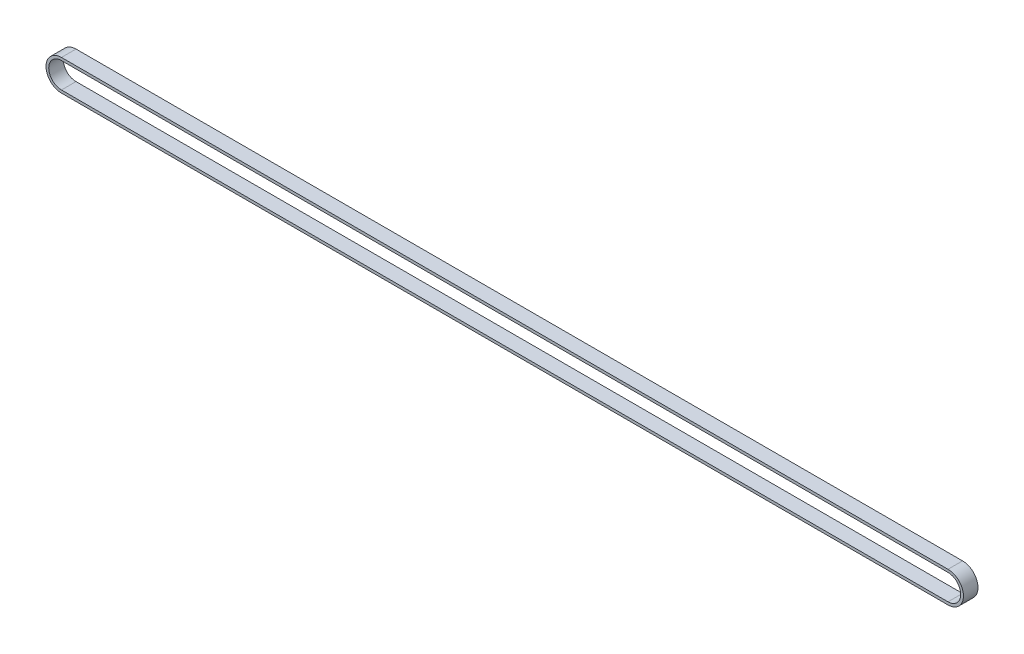
ISO-10303-21;
HEADER;
FILE_DESCRIPTION(('STEP AP214'),'2;1');
FILE_NAME('part.step','',(''),(''),'','','');
FILE_SCHEMA(('AUTOMOTIVE_DESIGN { 1 0 10303 214 1 1 1 1 }'));
ENDSEC;
DATA;
#1=APPLICATION_CONTEXT('core data for automotive mechanical design processes');
#2=APPLICATION_PROTOCOL_DEFINITION('international standard','automotive_design',2000,#1);
#3=PRODUCT_CONTEXT('',#1,'mechanical');
#4=PRODUCT('Part','Part','',(#3));
#5=PRODUCT_RELATED_PRODUCT_CATEGORY('part','',(#4));
#6=PRODUCT_DEFINITION_FORMATION('','',#4);
#7=PRODUCT_DEFINITION_CONTEXT('part definition',#1,'design');
#8=PRODUCT_DEFINITION('design','',#6,#7);
#9=PRODUCT_DEFINITION_SHAPE('','',#8);
#10=(LENGTH_UNIT() NAMED_UNIT(*) SI_UNIT(.MILLI.,.METRE.));
#11=(NAMED_UNIT(*) PLANE_ANGLE_UNIT() SI_UNIT($,.RADIAN.));
#12=(NAMED_UNIT(*) SI_UNIT($,.STERADIAN.) SOLID_ANGLE_UNIT());
#13=UNCERTAINTY_MEASURE_WITH_UNIT(LENGTH_MEASURE(1.E-05),#10,'distance_accuracy_value','');
#14=(GEOMETRIC_REPRESENTATION_CONTEXT(3) GLOBAL_UNCERTAINTY_ASSIGNED_CONTEXT((#13)) GLOBAL_UNIT_ASSIGNED_CONTEXT((#10,
#11,#12)) REPRESENTATION_CONTEXT('',''));
#15=CARTESIAN_POINT('',(0.,0.,0.));
#16=DIRECTION('',(0.,0.,1.));
#17=DIRECTION('',(1.,0.,0.));
#18=AXIS2_PLACEMENT_3D('',#15,#16,#17);
#19=CARTESIAN_POINT('',(0.,0.,6.4));
#20=DIRECTION('',(0.,0.,1.));
#21=DIRECTION('',(1.,0.,0.));
#22=AXIS2_PLACEMENT_3D('',#19,#20,#21);
#23=PLANE('',#22);
#24=CARTESIAN_POINT('',(0.,0.,6.4));
#25=DIRECTION('',(0.,0.,1.));
#26=DIRECTION('',(1.,0.,0.));
#27=AXIS2_PLACEMENT_3D('',#24,#25,#26);
#28=CIRCLE('',#27,6.80000000000008);
#29=CARTESIAN_POINT('',(0.,-6.80000000000008,6.4));
#30=VERTEX_POINT('',#29);
#31=CARTESIAN_POINT('',(0.,6.80000000000008,6.4));
#32=VERTEX_POINT('',#31);
#33=EDGE_CURVE('E134',#30,#32,#28,.T.);
#34=ORIENTED_EDGE('',*,*,#33,.T.);
#35=DIRECTION('',(-1.,0.,0.));
#36=VECTOR('',#35,1.);
#37=CARTESIAN_POINT('',(0.,6.80000000000008,6.4));
#38=LINE('',#37,#36);
#39=CARTESIAN_POINT('',(-390.,6.8,6.4));
#40=VERTEX_POINT('',#39);
#41=EDGE_CURVE('E137',#32,#40,#38,.T.);
#42=ORIENTED_EDGE('',*,*,#41,.T.);
#43=CARTESIAN_POINT('',(-390.,0.,6.4));
#44=DIRECTION('',(0.,0.,1.));
#45=DIRECTION('',(1.,0.,0.));
#46=AXIS2_PLACEMENT_3D('',#43,#44,#45);
#47=CIRCLE('',#46,6.80000000000009);
#48=CARTESIAN_POINT('',(-390.,-6.80000000000009,6.4));
#49=VERTEX_POINT('',#48);
#50=EDGE_CURVE('E140',#40,#49,#47,.T.);
#51=ORIENTED_EDGE('',*,*,#50,.T.);
#52=DIRECTION('',(1.,0.,0.));
#53=VECTOR('',#52,1.);
#54=CARTESIAN_POINT('',(0.,-6.80000000000008,6.4));
#55=LINE('',#54,#53);
#56=EDGE_CURVE('E142',#49,#30,#55,.T.);
#57=ORIENTED_EDGE('',*,*,#56,.T.);
#58=EDGE_LOOP('',(#34,#42,#51,#57));
#59=FACE_BOUND('',#58,.T.);
#60=DIRECTION('',(-1.,0.,0.));
#61=VECTOR('',#60,1.);
#62=CARTESIAN_POINT('',(0.,5.60000000000008,6.4));
#63=LINE('',#62,#61);
#64=CARTESIAN_POINT('',(0.,5.60000000000008,6.4));
#65=VERTEX_POINT('',#64);
#66=CARTESIAN_POINT('',(-390.,5.60000000000008,6.4));
#67=VERTEX_POINT('',#66);
#68=EDGE_CURVE('E106',#65,#67,#63,.T.);
#69=ORIENTED_EDGE('',*,*,#68,.F.);
#70=CARTESIAN_POINT('',(0.,0.,6.4));
#71=DIRECTION('',(0.,0.,1.));
#72=DIRECTION('',(1.,0.,0.));
#73=AXIS2_PLACEMENT_3D('',#70,#71,#72);
#74=CIRCLE('',#73,5.60000000000008);
#75=CARTESIAN_POINT('',(0.,-5.60000000000008,6.4));
#76=VERTEX_POINT('',#75);
#77=EDGE_CURVE('E98',#76,#65,#74,.T.);
#78=ORIENTED_EDGE('',*,*,#77,.F.);
#79=DIRECTION('',(1.,0.,0.));
#80=VECTOR('',#79,1.);
#81=CARTESIAN_POINT('',(0.,-5.60000000000008,6.4));
#82=LINE('',#81,#80);
#83=CARTESIAN_POINT('',(-390.,-5.60000000000025,6.4));
#84=VERTEX_POINT('',#83);
#85=EDGE_CURVE('E120',#84,#76,#82,.T.);
#86=ORIENTED_EDGE('',*,*,#85,.F.);
#87=CARTESIAN_POINT('',(-390.,0.,6.4));
#88=DIRECTION('',(0.,0.,1.));
#89=DIRECTION('',(1.,0.,0.));
#90=AXIS2_PLACEMENT_3D('',#87,#88,#89);
#91=CIRCLE('',#90,5.60000000000017);
#92=EDGE_CURVE('E118',#67,#84,#91,.T.);
#93=ORIENTED_EDGE('',*,*,#92,.F.);
#94=EDGE_LOOP('',(#69,#78,#86,#93));
#95=FACE_BOUND('',#94,.T.);
#96=ADVANCED_FACE('F33',(#59,#95),#23,.T.);
#97=CARTESIAN_POINT('',(0.,0.,0.));
#98=DIRECTION('',(0.,0.,1.));
#99=DIRECTION('',(1.,0.,0.));
#100=AXIS2_PLACEMENT_3D('',#97,#98,#99);
#101=PLANE('',#100);
#102=CARTESIAN_POINT('',(0.,0.,0.));
#103=DIRECTION('',(0.,0.,1.));
#104=DIRECTION('',(1.,0.,0.));
#105=AXIS2_PLACEMENT_3D('',#102,#103,#104);
#106=CIRCLE('',#105,6.80000000000008);
#107=CARTESIAN_POINT('',(0.,-6.80000000000008,0.));
#108=VERTEX_POINT('',#107);
#109=CARTESIAN_POINT('',(0.,6.80000000000008,0.));
#110=VERTEX_POINT('',#109);
#111=EDGE_CURVE('E114',#108,#110,#106,.T.);
#112=ORIENTED_EDGE('',*,*,#111,.F.);
#113=DIRECTION('',(1.,0.,0.));
#114=VECTOR('',#113,1.);
#115=CARTESIAN_POINT('',(0.,-6.80000000000008,0.));
#116=LINE('',#115,#114);
#117=CARTESIAN_POINT('',(-390.,-6.80000000000009,0.));
#118=VERTEX_POINT('',#117);
#119=EDGE_CURVE('E138',#118,#108,#116,.T.);
#120=ORIENTED_EDGE('',*,*,#119,.F.);
#121=CARTESIAN_POINT('',(-390.,0.,0.));
#122=DIRECTION('',(0.,0.,1.));
#123=DIRECTION('',(1.,0.,0.));
#124=AXIS2_PLACEMENT_3D('',#121,#122,#123);
#125=CIRCLE('',#124,6.80000000000009);
#126=CARTESIAN_POINT('',(-390.,6.8,0.));
#127=VERTEX_POINT('',#126);
#128=EDGE_CURVE('E149',#127,#118,#125,.T.);
#129=ORIENTED_EDGE('',*,*,#128,.F.);
#130=DIRECTION('',(-1.,0.,0.));
#131=VECTOR('',#130,1.);
#132=CARTESIAN_POINT('',(0.,6.80000000000008,0.));
#133=LINE('',#132,#131);
#134=EDGE_CURVE('E147',#110,#127,#133,.T.);
#135=ORIENTED_EDGE('',*,*,#134,.F.);
#136=EDGE_LOOP('',(#112,#120,#129,#135));
#137=FACE_BOUND('',#136,.T.);
#138=CARTESIAN_POINT('',(0.,0.,0.));
#139=DIRECTION('',(0.,0.,1.));
#140=DIRECTION('',(1.,0.,0.));
#141=AXIS2_PLACEMENT_3D('',#138,#139,#140);
#142=CIRCLE('',#141,5.60000000000008);
#143=CARTESIAN_POINT('',(0.,-5.60000000000008,0.));
#144=VERTEX_POINT('',#143);
#145=CARTESIAN_POINT('',(0.,5.60000000000008,0.));
#146=VERTEX_POINT('',#145);
#147=EDGE_CURVE('E56',#144,#146,#142,.T.);
#148=ORIENTED_EDGE('',*,*,#147,.T.);
#149=DIRECTION('',(-1.,0.,0.));
#150=VECTOR('',#149,1.);
#151=CARTESIAN_POINT('',(0.,5.60000000000008,0.));
#152=LINE('',#151,#150);
#153=CARTESIAN_POINT('',(-390.,5.60000000000008,0.));
#154=VERTEX_POINT('',#153);
#155=EDGE_CURVE('E113',#146,#154,#152,.T.);
#156=ORIENTED_EDGE('',*,*,#155,.T.);
#157=CARTESIAN_POINT('',(-390.,0.,0.));
#158=DIRECTION('',(0.,0.,1.));
#159=DIRECTION('',(1.,0.,0.));
#160=AXIS2_PLACEMENT_3D('',#157,#158,#159);
#161=CIRCLE('',#160,5.60000000000017);
#162=CARTESIAN_POINT('',(-390.,-5.60000000000025,0.));
#163=VERTEX_POINT('',#162);
#164=EDGE_CURVE('E126',#154,#163,#161,.T.);
#165=ORIENTED_EDGE('',*,*,#164,.T.);
#166=DIRECTION('',(1.,0.,0.));
#167=VECTOR('',#166,1.);
#168=CARTESIAN_POINT('',(0.,-5.60000000000008,0.));
#169=LINE('',#168,#167);
#170=EDGE_CURVE('E107',#163,#144,#169,.T.);
#171=ORIENTED_EDGE('',*,*,#170,.T.);
#172=EDGE_LOOP('',(#148,#156,#165,#171));
#173=FACE_BOUND('',#172,.T.);
#174=ADVANCED_FACE('F167',(#137,#173),#101,.F.);
#175=CARTESIAN_POINT('',(0.,0.,6.4));
#176=DIRECTION('',(0.,0.,-1.));
#177=DIRECTION('',(-1.,0.,0.));
#178=AXIS2_PLACEMENT_3D('',#175,#176,#177);
#179=CYLINDRICAL_SURFACE('',#178,6.80000000000008);
#180=ORIENTED_EDGE('',*,*,#111,.T.);
#181=DIRECTION('',(0.,0.,-1.));
#182=VECTOR('',#181,1.);
#183=CARTESIAN_POINT('',(0.,6.80000000000008,6.4));
#184=LINE('',#183,#182);
#185=EDGE_CURVE('E11',#32,#110,#184,.T.);
#186=ORIENTED_EDGE('',*,*,#185,.F.);
#187=ORIENTED_EDGE('',*,*,#33,.F.);
#188=DIRECTION('',(0.,0.,-1.));
#189=VECTOR('',#188,1.);
#190=CARTESIAN_POINT('',(0.,-6.80000000000008,6.4));
#191=LINE('',#190,#189);
#192=EDGE_CURVE('E144',#30,#108,#191,.T.);
#193=ORIENTED_EDGE('',*,*,#192,.T.);
#194=EDGE_LOOP('',(#180,#186,#187,#193));
#195=FACE_BOUND('',#194,.T.);
#196=ADVANCED_FACE('F35',(#195),#179,.T.);
#197=CARTESIAN_POINT('',(0.,6.80000000000008,6.4));
#198=DIRECTION('',(0.,-1.,0.));
#199=DIRECTION('',(1.,0.,0.));
#200=AXIS2_PLACEMENT_3D('',#197,#198,#199);
#201=PLANE('',#200);
#202=ORIENTED_EDGE('',*,*,#134,.T.);
#203=DIRECTION('',(0.,0.,-1.));
#204=VECTOR('',#203,1.);
#205=CARTESIAN_POINT('',(-390.,6.8,6.4));
#206=LINE('',#205,#204);
#207=EDGE_CURVE('E41',#40,#127,#206,.T.);
#208=ORIENTED_EDGE('',*,*,#207,.F.);
#209=ORIENTED_EDGE('',*,*,#41,.F.);
#210=ORIENTED_EDGE('',*,*,#185,.T.);
#211=EDGE_LOOP('',(#202,#208,#209,#210));
#212=FACE_BOUND('',#211,.T.);
#213=ADVANCED_FACE('F177',(#212),#201,.F.);
#214=CARTESIAN_POINT('',(-390.,0.,6.4));
#215=DIRECTION('',(0.,0.,-1.));
#216=DIRECTION('',(-1.,0.,0.));
#217=AXIS2_PLACEMENT_3D('',#214,#215,#216);
#218=CYLINDRICAL_SURFACE('',#217,6.80000000000009);
#219=ORIENTED_EDGE('',*,*,#128,.T.);
#220=DIRECTION('',(0.,0.,-1.));
#221=VECTOR('',#220,1.);
#222=CARTESIAN_POINT('',(-390.,-6.80000000000009,6.4));
#223=LINE('',#222,#221);
#224=EDGE_CURVE('E154',#49,#118,#223,.T.);
#225=ORIENTED_EDGE('',*,*,#224,.F.);
#226=ORIENTED_EDGE('',*,*,#50,.F.);
#227=ORIENTED_EDGE('',*,*,#207,.T.);
#228=EDGE_LOOP('',(#219,#225,#226,#227));
#229=FACE_BOUND('',#228,.T.);
#230=ADVANCED_FACE('F161',(#229),#218,.T.);
#231=CARTESIAN_POINT('',(0.,-6.80000000000008,6.4));
#232=DIRECTION('',(0.,1.,0.));
#233=DIRECTION('',(-1.,0.,0.));
#234=AXIS2_PLACEMENT_3D('',#231,#232,#233);
#235=PLANE('',#234);
#236=ORIENTED_EDGE('',*,*,#119,.T.);
#237=ORIENTED_EDGE('',*,*,#192,.F.);
#238=ORIENTED_EDGE('',*,*,#56,.F.);
#239=ORIENTED_EDGE('',*,*,#224,.T.);
#240=EDGE_LOOP('',(#236,#237,#238,#239));
#241=FACE_BOUND('',#240,.T.);
#242=ADVANCED_FACE('F171',(#241),#235,.F.);
#243=CARTESIAN_POINT('',(0.,0.,6.4));
#244=DIRECTION('',(0.,0.,-1.));
#245=DIRECTION('',(-1.,0.,0.));
#246=AXIS2_PLACEMENT_3D('',#243,#244,#245);
#247=CYLINDRICAL_SURFACE('',#246,5.60000000000008);
#248=ORIENTED_EDGE('',*,*,#147,.F.);
#249=DIRECTION('',(0.,0.,-1.));
#250=VECTOR('',#249,1.);
#251=CARTESIAN_POINT('',(0.,-5.60000000000008,6.4));
#252=LINE('',#251,#250);
#253=EDGE_CURVE('E102',#76,#144,#252,.T.);
#254=ORIENTED_EDGE('',*,*,#253,.F.);
#255=ORIENTED_EDGE('',*,*,#77,.T.);
#256=DIRECTION('',(0.,0.,-1.));
#257=VECTOR('',#256,1.);
#258=CARTESIAN_POINT('',(0.,5.60000000000008,6.4));
#259=LINE('',#258,#257);
#260=EDGE_CURVE('E101',#65,#146,#259,.T.);
#261=ORIENTED_EDGE('',*,*,#260,.T.);
#262=EDGE_LOOP('',(#248,#254,#255,#261));
#263=FACE_BOUND('',#262,.T.);
#264=ADVANCED_FACE('F100',(#263),#247,.F.);
#265=CARTESIAN_POINT('',(0.,5.60000000000008,6.4));
#266=DIRECTION('',(0.,-1.,0.));
#267=DIRECTION('',(1.,0.,0.));
#268=AXIS2_PLACEMENT_3D('',#265,#266,#267);
#269=PLANE('',#268);
#270=ORIENTED_EDGE('',*,*,#155,.F.);
#271=ORIENTED_EDGE('',*,*,#260,.F.);
#272=ORIENTED_EDGE('',*,*,#68,.T.);
#273=DIRECTION('',(0.,0.,-1.));
#274=VECTOR('',#273,1.);
#275=CARTESIAN_POINT('',(-390.,5.60000000000008,6.4));
#276=LINE('',#275,#274);
#277=EDGE_CURVE('E115',#67,#154,#276,.T.);
#278=ORIENTED_EDGE('',*,*,#277,.T.);
#279=EDGE_LOOP('',(#270,#271,#272,#278));
#280=FACE_BOUND('',#279,.T.);
#281=ADVANCED_FACE('F110',(#280),#269,.T.);
#282=CARTESIAN_POINT('',(-390.,0.,6.4));
#283=DIRECTION('',(0.,0.,-1.));
#284=DIRECTION('',(-1.,0.,0.));
#285=AXIS2_PLACEMENT_3D('',#282,#283,#284);
#286=CYLINDRICAL_SURFACE('',#285,5.60000000000017);
#287=ORIENTED_EDGE('',*,*,#164,.F.);
#288=ORIENTED_EDGE('',*,*,#277,.F.);
#289=ORIENTED_EDGE('',*,*,#92,.T.);
#290=DIRECTION('',(0.,0.,-1.));
#291=VECTOR('',#290,1.);
#292=CARTESIAN_POINT('',(-390.,-5.60000000000025,6.4));
#293=LINE('',#292,#291);
#294=EDGE_CURVE('E48',#84,#163,#293,.T.);
#295=ORIENTED_EDGE('',*,*,#294,.T.);
#296=EDGE_LOOP('',(#287,#288,#289,#295));
#297=FACE_BOUND('',#296,.T.);
#298=ADVANCED_FACE('F200',(#297),#286,.F.);
#299=CARTESIAN_POINT('',(0.,-5.60000000000008,6.4));
#300=DIRECTION('',(0.,1.,0.));
#301=DIRECTION('',(-1.,0.,0.));
#302=AXIS2_PLACEMENT_3D('',#299,#300,#301);
#303=PLANE('',#302);
#304=ORIENTED_EDGE('',*,*,#170,.F.);
#305=ORIENTED_EDGE('',*,*,#294,.F.);
#306=ORIENTED_EDGE('',*,*,#85,.T.);
#307=ORIENTED_EDGE('',*,*,#253,.T.);
#308=EDGE_LOOP('',(#304,#305,#306,#307));
#309=FACE_BOUND('',#308,.T.);
#310=ADVANCED_FACE('F204',(#309),#303,.T.);
#311=CLOSED_SHELL('',(#96,#174,#196,#213,#230,#242,#264,#281,#298,#310));
#312=MANIFOLD_SOLID_BREP('B2',#311);
#313=ADVANCED_BREP_SHAPE_REPRESENTATION('',(#18,#312),#14);
#314=SHAPE_DEFINITION_REPRESENTATION(#9,#313);
ENDSEC;
END-ISO-10303-21;
